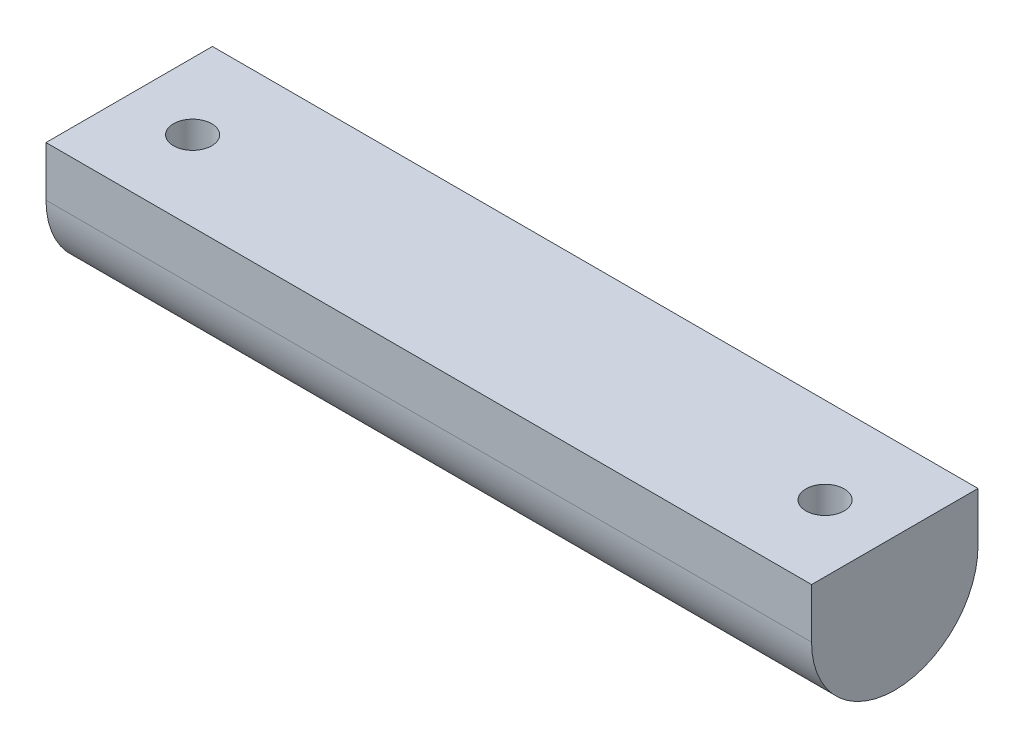
ISO-10303-21;
HEADER;
FILE_DESCRIPTION(('STEP AP214'),'2;1');
FILE_NAME('part.step','',(''),(''),'','','');
FILE_SCHEMA(('AUTOMOTIVE_DESIGN { 1 0 10303 214 1 1 1 1 }'));
ENDSEC;
DATA;
#1=APPLICATION_CONTEXT('core data for automotive mechanical design processes');
#2=APPLICATION_PROTOCOL_DEFINITION('international standard','automotive_design',2000,#1);
#3=PRODUCT_CONTEXT('',#1,'mechanical');
#4=PRODUCT('Part','Part','',(#3));
#5=PRODUCT_RELATED_PRODUCT_CATEGORY('part','',(#4));
#6=PRODUCT_DEFINITION_FORMATION('','',#4);
#7=PRODUCT_DEFINITION_CONTEXT('part definition',#1,'design');
#8=PRODUCT_DEFINITION('design','',#6,#7);
#9=PRODUCT_DEFINITION_SHAPE('','',#8);
#10=(LENGTH_UNIT() NAMED_UNIT(*) SI_UNIT(.MILLI.,.METRE.));
#11=(NAMED_UNIT(*) PLANE_ANGLE_UNIT() SI_UNIT($,.RADIAN.));
#12=(NAMED_UNIT(*) SI_UNIT($,.STERADIAN.) SOLID_ANGLE_UNIT());
#13=UNCERTAINTY_MEASURE_WITH_UNIT(LENGTH_MEASURE(1.E-05),#10,'distance_accuracy_value','');
#14=(GEOMETRIC_REPRESENTATION_CONTEXT(3) GLOBAL_UNCERTAINTY_ASSIGNED_CONTEXT((#13)) GLOBAL_UNIT_ASSIGNED_CONTEXT((#10,
#11,#12)) REPRESENTATION_CONTEXT('',''));
#15=CARTESIAN_POINT('',(0.,0.,0.));
#16=DIRECTION('',(0.,0.,1.));
#17=DIRECTION('',(1.,0.,0.));
#18=AXIS2_PLACEMENT_3D('',#15,#16,#17);
#19=CARTESIAN_POINT('',(230.,0.,-0.953079178885622));
#20=DIRECTION('',(-1.,0.,0.));
#21=DIRECTION('',(0.,0.,1.));
#22=AXIS2_PLACEMENT_3D('',#19,#20,#21);
#23=CYLINDRICAL_SURFACE('',#22,25.);
#24=CARTESIAN_POINT('',(14.3295379307525,-25.,-0.953079178885622));
#25=CARTESIAN_POINT('',(14.3032204154449,-25.0000022390417,-0.796524944286666));
#26=CARTESIAN_POINT('',(14.283403547646,-24.9985271644358,-0.638926225067683));
#27=CARTESIAN_POINT('',(14.2568675350783,-24.9925495309535,-0.322641837007087));
#28=CARTESIAN_POINT('',(14.2501500199997,-24.9880465954746,-0.163956035385695));
#29=CARTESIAN_POINT('',(14.2498548638924,-24.9760090292573,0.153357104046602));
#30=CARTESIAN_POINT('',(14.2562815027579,-24.968473411683,0.311984405988229));
#31=CARTESIAN_POINT('',(14.2822036954214,-24.9504523086873,0.628057321523648));
#32=CARTESIAN_POINT('',(14.301704000259,-24.9399657516831,0.785502484481084));
#33=CARTESIAN_POINT('',(14.3535591325346,-24.9162249444227,1.09783111698485));
#34=CARTESIAN_POINT('',(14.3858968706514,-24.9029743847184,1.25271770815543));
#35=CARTESIAN_POINT('',(14.4631618678009,-24.8739317342173,1.55913381445163));
#36=CARTESIAN_POINT('',(14.5080937771886,-24.8581387055411,1.71066206717816));
#37=CARTESIAN_POINT('',(14.6101588531816,-24.8243289375947,2.00922693484971));
#38=CARTESIAN_POINT('',(14.6672872413105,-24.806313070377,2.1562652831865));
#39=CARTESIAN_POINT('',(14.793344159261,-24.7684117634486,2.4450073157346));
#40=CARTESIAN_POINT('',(14.8622771290898,-24.7485256215527,2.58670896812298));
#41=CARTESIAN_POINT('',(15.0125043460582,-24.7070087819824,2.86580925068788));
#42=CARTESIAN_POINT('',(15.093961883232,-24.6853571335696,3.00311687185976));
#43=CARTESIAN_POINT('',(15.2679519624222,-24.6410307973897,3.2704224231089));
#44=CARTESIAN_POINT('',(15.3604885779391,-24.6183557352597,3.40041763861691));
#45=CARTESIAN_POINT('',(15.5559706367322,-24.5725021167474,3.65219087190974));
#46=CARTESIAN_POINT('',(15.6589138903542,-24.5493236670851,3.7739706093542));
#47=CARTESIAN_POINT('',(15.8745960253436,-24.5029785853046,4.00860901804945));
#48=CARTESIAN_POINT('',(15.9873385465955,-24.4798119608205,4.12146434439365));
#49=CARTESIAN_POINT('',(16.2245109406561,-24.4335239826306,4.33990222858453));
#50=CARTESIAN_POINT('',(16.3491465612219,-24.4104153523268,4.4452642806977));
#51=CARTESIAN_POINT('',(16.6070983124857,-24.3653525353509,4.64514350609272));
#52=CARTESIAN_POINT('',(16.7404177071474,-24.3433987884339,4.7396565642697));
#53=CARTESIAN_POINT('',(17.0147774820477,-24.3012272095911,4.91707232793482));
#54=CARTESIAN_POINT('',(17.1558147906821,-24.2810086951815,4.99997960626002));
#55=CARTESIAN_POINT('',(17.4446685580712,-24.2428274199846,5.15360202695747));
#56=CARTESIAN_POINT('',(17.5924874406972,-24.2248654744517,5.22431276637825));
#57=CARTESIAN_POINT('',(18.0418252284578,-24.1754507249369,5.41599818377823));
#58=CARTESIAN_POINT('',(18.3521172945124,-24.1480095861662,5.51839392862714));
#59=CARTESIAN_POINT('',(18.8272894700967,-24.1173084184242,5.63151256662128));
#60=CARTESIAN_POINT('',(18.9873613114815,-24.1088169599469,5.66247676103014));
#61=CARTESIAN_POINT('',(19.3097214068093,-24.0955208220363,5.71074058200066));
#62=CARTESIAN_POINT('',(19.4720096513324,-24.0907161269386,5.72804026661975));
#63=CARTESIAN_POINT('',(19.9495027262995,-24.0822917206927,5.75840022909593));
#64=CARTESIAN_POINT('',(20.2662293187365,-24.0839518559656,5.7524753782797));
#65=CARTESIAN_POINT('',(20.8938445772999,-24.101568017326,5.68886320348814));
#66=CARTESIAN_POINT('',(21.2047335191238,-24.1175233665438,5.63117833031799));
#67=CARTESIAN_POINT('',(21.8090862492864,-24.161771868801,5.46688007665178));
#68=CARTESIAN_POINT('',(22.1026905479246,-24.1899430233636,5.36074997723819));
#69=CARTESIAN_POINT('',(22.6680377955221,-24.2557509483203,5.10300418130992));
#70=CARTESIAN_POINT('',(22.9397774901488,-24.2933891243609,4.95138172952665));
#71=CARTESIAN_POINT('',(23.4617483561664,-24.3756445451164,4.60217979134951));
#72=CARTESIAN_POINT('',(23.7111906053401,-24.4204241606182,4.40345949495601));
#73=CARTESIAN_POINT('',(24.1737288000628,-24.5119230961102,3.9678036105785));
#74=CARTESIAN_POINT('',(24.3868185454067,-24.5586427453021,3.73086151694776));
#75=CARTESIAN_POINT('',(24.7762284467125,-24.6509717942483,3.21814108837073));
#76=CARTESIAN_POINT('',(24.9514418894326,-24.6965202521211,2.94150950299253));
#77=CARTESIAN_POINT('',(25.2527536727956,-24.7809950765968,2.36173412056259));
#78=CARTESIAN_POINT('',(25.3788547981598,-24.8199218185875,2.05859182789039));
#79=CARTESIAN_POINT('',(25.5770408455131,-24.8874452912236,1.43688506829215));
#80=CARTESIAN_POINT('',(25.649576545965,-24.916127154581,1.11847389005601));
#81=CARTESIAN_POINT('',(25.7397499806507,-24.9613785471944,0.473142045587918));
#82=CARTESIAN_POINT('',(25.7573976174883,-24.9779502608844,0.146222925045543));
#83=CARTESIAN_POINT('',(25.7372344944008,-24.9978728887552,-0.497655944596847));
#84=CARTESIAN_POINT('',(25.7008709726389,-25.0015602488029,-0.814651380411591));
#85=CARTESIAN_POINT('',(25.5763056273417,-24.9972378554185,-1.43818859021589));
#86=CARTESIAN_POINT('',(25.488105458735,-24.9892284754026,-1.74473069760623));
#87=CARTESIAN_POINT('',(25.263221994896,-24.96342631561,-2.3368084254988));
#88=CARTESIAN_POINT('',(25.1268442191378,-24.9456948065083,-2.62246303467202));
#89=CARTESIAN_POINT('',(24.809436808048,-24.9032601485104,-3.16721047549525));
#90=CARTESIAN_POINT('',(24.6284023060163,-24.8785562397182,-3.42630040776122));
#91=CARTESIAN_POINT('',(24.2229863326904,-24.825096932549,-3.915562522357));
#92=CARTESIAN_POINT('',(23.9978808946622,-24.7962764074241,-4.14512777040046));
#93=CARTESIAN_POINT('',(23.5126003937988,-24.7388068982349,-4.56364199458479));
#94=CARTESIAN_POINT('',(23.2524223477359,-24.7101579289796,-4.75258751211614));
#95=CARTESIAN_POINT('',(22.7004559417886,-24.6564716664804,-5.08678518840574));
#96=CARTESIAN_POINT('',(22.4083112158132,-24.6314843218128,-5.2314580086546));
#97=CARTESIAN_POINT('',(21.8033753867401,-24.5889435332959,-5.46955577290564));
#98=CARTESIAN_POINT('',(21.4905862082165,-24.5713893976158,-5.56298548649498));
#99=CARTESIAN_POINT('',(20.8567322291751,-24.5462763735618,-5.69490567699094));
#100=CARTESIAN_POINT('',(20.535800283754,-24.5386071557003,-5.73400297157918));
#101=CARTESIAN_POINT('',(20.0531657004183,-24.5350776764996,-5.75202061225854));
#102=CARTESIAN_POINT('',(19.8919991888074,-24.5352323500366,-5.75124437152855));
#103=CARTESIAN_POINT('',(19.5703396124318,-24.5381753170595,-5.73618007747943));
#104=CARTESIAN_POINT('',(19.409846316616,-24.5409626173237,-5.72189711989138));
#105=CARTESIAN_POINT('',(19.0928257192927,-24.5490260317769,-5.6802085251814));
#106=CARTESIAN_POINT('',(18.9362740630109,-24.5542685240284,-5.65298009196802));
#107=CARTESIAN_POINT('',(18.6261038156137,-24.5670504877621,-5.58570303374321));
#108=CARTESIAN_POINT('',(18.4724841704097,-24.5745891165759,-5.54565911166669));
#109=CARTESIAN_POINT('',(18.1691275584556,-24.5917187566403,-5.45303300264966));
#110=CARTESIAN_POINT('',(18.019392113054,-24.6013105588574,-5.40044598269966));
#111=CARTESIAN_POINT('',(17.7249340354364,-24.6222262382754,-5.28315079331366));
#112=CARTESIAN_POINT('',(17.5802096877731,-24.6335495154056,-5.21844682146513));
#113=CARTESIAN_POINT('',(17.2954638374411,-24.6576654120095,-5.07675983215242));
#114=CARTESIAN_POINT('',(17.1554935671313,-24.6704698452532,-4.99967586990379));
#115=CARTESIAN_POINT('',(16.8825657709456,-24.697041485555,-4.8342075718708));
#116=CARTESIAN_POINT('',(16.7496058056591,-24.710808353779,-4.74582720410239));
#117=CARTESIAN_POINT('',(16.4914515466829,-24.7388643196716,-4.55829523136982));
#118=CARTESIAN_POINT('',(16.3662618338497,-24.7531537176498,-4.45913736566428));
#119=CARTESIAN_POINT('',(16.1246067331412,-24.781769730818,-4.25079633812985));
#120=CARTESIAN_POINT('',(16.0081382641369,-24.7960963309963,-4.14161674750938));
#121=CARTESIAN_POINT('',(15.7828240743822,-24.8245447604804,-3.91205989283182));
#122=CARTESIAN_POINT('',(15.6741342207759,-24.8386594060363,-3.79152866588576));
#123=CARTESIAN_POINT('',(15.4673195188152,-24.8659376692751,-3.54169423770944));
#124=CARTESIAN_POINT('',(15.3691908915723,-24.8791016265633,-3.41239420120246));
#125=CARTESIAN_POINT('',(15.1841934612556,-24.9040026272062,-3.14591753477112));
#126=CARTESIAN_POINT('',(15.0973198944612,-24.9157402741173,-3.00874427290967));
#127=CARTESIAN_POINT('',(14.9354473423227,-24.9373498372926,-2.72748018558901));
#128=CARTESIAN_POINT('',(14.8604462879265,-24.9472220787038,-2.58339057117635));
#129=CARTESIAN_POINT('',(14.6817363527919,-24.9699253296153,-2.20131543691505));
#130=CARTESIAN_POINT('',(14.587634371607,-24.9810020754608,-1.95864742197571));
#131=CARTESIAN_POINT('',(14.4330673642174,-24.9960373687909,-1.46261106400319));
#132=CARTESIAN_POINT('',(14.3726003531728,-24.9999963363349,-1.20924335332143));
#133=CARTESIAN_POINT('',(14.3295379307525,-25.,-0.953079178885622));
#134=B_SPLINE_CURVE_WITH_KNOTS('',3,(#24,#25,#26,#27,#28,#29,#30,#31,#32,#33,#34,#35,#36,#37,
#38,#39,#40,#41,#42,#43,#44,#45,#46,#47,#48,#49,#50,#51,#52,#53,#54,#55,#56,#57,#58,#59,#60,#61,
#62,#63,#64,#65,#66,#67,#68,#69,#70,#71,#72,#73,#74,#75,#76,#77,#78,#79,#80,#81,#82,#83,#84,#85,
#86,#87,#88,#89,#90,#91,#92,#93,#94,#95,#96,#97,#98,#99,#100,#101,#102,#103,#104,#105,#106,#107,
#108,#109,#110,#111,#112,#113,#114,#115,#116,#117,#118,#119,#120,#121,#122,#123,#124,#125,#126,
#127,#128,#129,#130,#131,#132,#133),.UNSPECIFIED.,.T.,.F.,(4,2,2,2,2,2,2,2,2,2,2,2,2,2,2,2,2,2,
2,2,2,2,2,2,2,2,2,2,2,2,2,2,2,2,2,2,2,2,2,2,2,2,2,2,2,2,2,2,2,2,2,2,2,2,4),(0.,
0.476027169707608,0.952113558168828,1.42835499074974,1.90476958587459,2.38055208842228,
2.85651050399832,3.33228278422398,3.8082344092945,4.29102054989,4.77398474719205,
5.25684753497594,5.73989045232327,6.23379148640104,6.72787924608981,7.2217717771171,
7.71584223191195,8.69369312824933,9.18296735713278,9.67223950718872,10.6176082383934,
11.5629322093329,12.4990252115377,13.4352572852916,14.3970282615393,15.3589631117399,
16.3460419759306,17.3330648635349,18.311683755875,19.2901260809113,20.2428194208548,
21.195482346912,22.1422092935145,23.0890394602514,24.0529736843132,25.016989951086,
25.9931290497532,26.9691772762768,27.9342343203263,28.4172539535452,28.9000914287583,
29.3765019534605,29.8527378485778,30.3291575405038,30.8054124941125,31.2857688066602,
31.7659568488638,32.2464253425575,32.7267232826935,33.2148783192506,33.7028581053767,
34.1906306738721,34.6783181432289,35.4572705895087,36.2361770639937),.UNSPECIFIED.);
#135=CARTESIAN_POINT('',(14.3295379307525,-25.,-0.953079178885622));
#136=VERTEX_POINT('',#135);
#137=EDGE_CURVE('E11',#136,#136,#134,.T.);
#138=ORIENTED_EDGE('',*,*,#137,.T.);
#139=EDGE_LOOP('',(#138));
#140=FACE_BOUND('',#139,.T.);
#141=CARTESIAN_POINT('',(204.329537930752,-25.,-0.953079178885622));
#142=CARTESIAN_POINT('',(204.303220415445,-25.0000022390417,-0.796524944286666));
#143=CARTESIAN_POINT('',(204.283403547646,-24.9985271644358,-0.638926225067683));
#144=CARTESIAN_POINT('',(204.256867535078,-24.9925495309535,-0.322641837007086));
#145=CARTESIAN_POINT('',(204.25015002,-24.9880465954746,-0.163956035385692));
#146=CARTESIAN_POINT('',(204.249854863892,-24.9760090292573,0.153357104046608));
#147=CARTESIAN_POINT('',(204.256281502758,-24.968473411683,0.311984405988236));
#148=CARTESIAN_POINT('',(204.282203695421,-24.9504523086873,0.628057321523656));
#149=CARTESIAN_POINT('',(204.301704000259,-24.9399657516831,0.785502484481091));
#150=CARTESIAN_POINT('',(204.353559132535,-24.9162249444227,1.09783111698486));
#151=CARTESIAN_POINT('',(204.385896870651,-24.9029743847184,1.25271770815544));
#152=CARTESIAN_POINT('',(204.463161867801,-24.8739317342173,1.55913381445164));
#153=CARTESIAN_POINT('',(204.508093777189,-24.8581387055411,1.71066206717816));
#154=CARTESIAN_POINT('',(204.610158853182,-24.8243289375947,2.00922693484971));
#155=CARTESIAN_POINT('',(204.667287241311,-24.806313070377,2.15626528318651));
#156=CARTESIAN_POINT('',(204.793344159261,-24.7684117634486,2.44500731573462));
#157=CARTESIAN_POINT('',(204.86227712909,-24.7485256215527,2.58670896812299));
#158=CARTESIAN_POINT('',(205.012504346058,-24.7070087819824,2.86580925068789));
#159=CARTESIAN_POINT('',(205.093961883232,-24.6853571335696,3.00311687185978));
#160=CARTESIAN_POINT('',(205.267951962422,-24.6410307973897,3.27042242310891));
#161=CARTESIAN_POINT('',(205.360488577939,-24.6183557352597,3.40041763861692));
#162=CARTESIAN_POINT('',(205.555970636732,-24.5725021167474,3.65219087190975));
#163=CARTESIAN_POINT('',(205.658913890354,-24.5493236670851,3.77397060935421));
#164=CARTESIAN_POINT('',(205.874596025344,-24.5029785853046,4.00860901804946));
#165=CARTESIAN_POINT('',(205.987338546596,-24.4798119608205,4.12146434439365));
#166=CARTESIAN_POINT('',(206.224510940656,-24.4335239826306,4.33990222858454));
#167=CARTESIAN_POINT('',(206.349146561222,-24.4104153523268,4.4452642806977));
#168=CARTESIAN_POINT('',(206.607098312486,-24.3653525353509,4.64514350609273));
#169=CARTESIAN_POINT('',(206.740417707147,-24.3433987884339,4.73965656426971));
#170=CARTESIAN_POINT('',(207.014777482048,-24.3012272095911,4.91707232793483));
#171=CARTESIAN_POINT('',(207.155814790682,-24.2810086951815,4.99997960626003));
#172=CARTESIAN_POINT('',(207.444668558071,-24.2428274199846,5.15360202695748));
#173=CARTESIAN_POINT('',(207.592487440697,-24.2248654744517,5.22431276637826));
#174=CARTESIAN_POINT('',(208.041825228458,-24.1754507249369,5.41599818377823));
#175=CARTESIAN_POINT('',(208.352117294512,-24.1480095861662,5.51839392862714));
#176=CARTESIAN_POINT('',(208.827289470097,-24.1173084184242,5.63151256662129));
#177=CARTESIAN_POINT('',(208.987361311481,-24.1088169599469,5.66247676103015));
#178=CARTESIAN_POINT('',(209.309721406809,-24.0955208220363,5.71074058200066));
#179=CARTESIAN_POINT('',(209.472009651332,-24.0907161269386,5.72804026661975));
#180=CARTESIAN_POINT('',(209.949502726299,-24.0822917206927,5.75840022909593));
#181=CARTESIAN_POINT('',(210.266229318737,-24.0839518559656,5.7524753782797));
#182=CARTESIAN_POINT('',(210.8938445773,-24.101568017326,5.68886320348814));
#183=CARTESIAN_POINT('',(211.204733519124,-24.1175233665438,5.63117833031798));
#184=CARTESIAN_POINT('',(211.809086249286,-24.161771868801,5.46688007665177));
#185=CARTESIAN_POINT('',(212.102690547925,-24.1899430233636,5.36074997723818));
#186=CARTESIAN_POINT('',(212.668037795522,-24.2557509483203,5.10300418130992));
#187=CARTESIAN_POINT('',(212.939777490149,-24.2933891243609,4.95138172952665));
#188=CARTESIAN_POINT('',(213.461748356166,-24.3756445451164,4.6021797913495));
#189=CARTESIAN_POINT('',(213.71119060534,-24.4204241606182,4.403459494956));
#190=CARTESIAN_POINT('',(214.173728800063,-24.5119230961102,3.96780361057849));
#191=CARTESIAN_POINT('',(214.386818545407,-24.5586427453021,3.73086151694775));
#192=CARTESIAN_POINT('',(214.776228446712,-24.6509717942483,3.21814108837073));
#193=CARTESIAN_POINT('',(214.951441889433,-24.6965202521211,2.94150950299252));
#194=CARTESIAN_POINT('',(215.252753672796,-24.7809950765968,2.36173412056258));
#195=CARTESIAN_POINT('',(215.37885479816,-24.8199218185875,2.05859182789038));
#196=CARTESIAN_POINT('',(215.577040845513,-24.8874452912236,1.43688506829214));
#197=CARTESIAN_POINT('',(215.649576545965,-24.916127154581,1.118473890056));
#198=CARTESIAN_POINT('',(215.739749980651,-24.9613785471944,0.473142045587905));
#199=CARTESIAN_POINT('',(215.757397617488,-24.9779502608844,0.146222925045531));
#200=CARTESIAN_POINT('',(215.737234494401,-24.9978728887552,-0.497655944596858));
#201=CARTESIAN_POINT('',(215.700870972639,-25.0015602488029,-0.814651380411601));
#202=CARTESIAN_POINT('',(215.576305627342,-24.9972378554185,-1.4381885902159));
#203=CARTESIAN_POINT('',(215.488105458735,-24.9892284754026,-1.74473069760624));
#204=CARTESIAN_POINT('',(215.263221994896,-24.96342631561,-2.3368084254988));
#205=CARTESIAN_POINT('',(215.126844219138,-24.9456948065083,-2.62246303467203));
#206=CARTESIAN_POINT('',(214.809436808048,-24.9032601485104,-3.16721047549525));
#207=CARTESIAN_POINT('',(214.628402306016,-24.8785562397182,-3.42630040776123));
#208=CARTESIAN_POINT('',(214.22298633269,-24.825096932549,-3.91556252235701));
#209=CARTESIAN_POINT('',(213.997880894662,-24.7962764074241,-4.14512777040047));
#210=CARTESIAN_POINT('',(213.512600393799,-24.7388068982349,-4.5636419945848));
#211=CARTESIAN_POINT('',(213.252422347736,-24.7101579289796,-4.75258751211615));
#212=CARTESIAN_POINT('',(212.700455941789,-24.6564716664804,-5.08678518840576));
#213=CARTESIAN_POINT('',(212.408311215813,-24.6314843218128,-5.2314580086546));
#214=CARTESIAN_POINT('',(211.80337538674,-24.5889435332959,-5.46955577290565));
#215=CARTESIAN_POINT('',(211.490586208216,-24.5713893976158,-5.56298548649499));
#216=CARTESIAN_POINT('',(210.856732229175,-24.5462763735618,-5.69490567699094));
#217=CARTESIAN_POINT('',(210.535800283754,-24.5386071557003,-5.73400297157918));
#218=CARTESIAN_POINT('',(210.053165700418,-24.5350776764996,-5.75202061225854));
#219=CARTESIAN_POINT('',(209.891999188807,-24.5352323500366,-5.75124437152855));
#220=CARTESIAN_POINT('',(209.570339612432,-24.5381753170595,-5.73618007747943));
#221=CARTESIAN_POINT('',(209.409846316616,-24.5409626173237,-5.72189711989138));
#222=CARTESIAN_POINT('',(209.092825719293,-24.5490260317769,-5.6802085251814));
#223=CARTESIAN_POINT('',(208.936274063011,-24.5542685240284,-5.65298009196802));
#224=CARTESIAN_POINT('',(208.626103815614,-24.5670504877621,-5.58570303374321));
#225=CARTESIAN_POINT('',(208.47248417041,-24.5745891165759,-5.54565911166669));
#226=CARTESIAN_POINT('',(208.169127558456,-24.5917187566403,-5.45303300264966));
#227=CARTESIAN_POINT('',(208.019392113054,-24.6013105588574,-5.40044598269966));
#228=CARTESIAN_POINT('',(207.724934035436,-24.6222262382754,-5.28315079331366));
#229=CARTESIAN_POINT('',(207.580209687773,-24.6335495154056,-5.21844682146512));
#230=CARTESIAN_POINT('',(207.295463837441,-24.6576654120095,-5.07675983215241));
#231=CARTESIAN_POINT('',(207.155493567131,-24.6704698452532,-4.99967586990378));
#232=CARTESIAN_POINT('',(206.882565770946,-24.697041485555,-4.8342075718708));
#233=CARTESIAN_POINT('',(206.749605805659,-24.710808353779,-4.74582720410239));
#234=CARTESIAN_POINT('',(206.491451546683,-24.7388643196716,-4.55829523136982));
#235=CARTESIAN_POINT('',(206.36626183385,-24.7531537176498,-4.45913736566428));
#236=CARTESIAN_POINT('',(206.124606733141,-24.781769730818,-4.25079633812984));
#237=CARTESIAN_POINT('',(206.008138264137,-24.7960963309963,-4.14161674750937));
#238=CARTESIAN_POINT('',(205.782824074382,-24.8245447604804,-3.9120598928318));
#239=CARTESIAN_POINT('',(205.674134220776,-24.8386594060363,-3.79152866588575));
#240=CARTESIAN_POINT('',(205.467319518815,-24.8659376692751,-3.54169423770943));
#241=CARTESIAN_POINT('',(205.369190891572,-24.8791016265633,-3.41239420120245));
#242=CARTESIAN_POINT('',(205.184193461256,-24.9040026272062,-3.14591753477111));
#243=CARTESIAN_POINT('',(205.097319894461,-24.9157402741173,-3.00874427290967));
#244=CARTESIAN_POINT('',(204.935447342323,-24.9373498372926,-2.72748018558901));
#245=CARTESIAN_POINT('',(204.860446287927,-24.9472220787038,-2.58339057117635));
#246=CARTESIAN_POINT('',(204.681736352792,-24.9699253296153,-2.20131543691505));
#247=CARTESIAN_POINT('',(204.587634371607,-24.9810020754608,-1.95864742197571));
#248=CARTESIAN_POINT('',(204.433067364217,-24.9960373687909,-1.46261106400319));
#249=CARTESIAN_POINT('',(204.372600353173,-24.9999963363349,-1.20924335332144));
#250=CARTESIAN_POINT('',(204.329537930752,-25.,-0.953079178885622));
#251=B_SPLINE_CURVE_WITH_KNOTS('',3,(#141,#142,#143,#144,#145,#146,#147,#148,#149,#150,#151,
#152,#153,#154,#155,#156,#157,#158,#159,#160,#161,#162,#163,#164,#165,#166,#167,#168,#169,#170,
#171,#172,#173,#174,#175,#176,#177,#178,#179,#180,#181,#182,#183,#184,#185,#186,#187,#188,#189,
#190,#191,#192,#193,#194,#195,#196,#197,#198,#199,#200,#201,#202,#203,#204,#205,#206,#207,#208,
#209,#210,#211,#212,#213,#214,#215,#216,#217,#218,#219,#220,#221,#222,#223,#224,#225,#226,#227,
#228,#229,#230,#231,#232,#233,#234,#235,#236,#237,#238,#239,#240,#241,#242,#243,#244,#245,#246,
#247,#248,#249,#250),.UNSPECIFIED.,.T.,.F.,(4,2,2,2,2,2,2,2,2,2,2,2,2,2,2,2,2,2,2,2,2,2,2,2,2,2,
2,2,2,2,2,2,2,2,2,2,2,2,2,2,2,2,2,2,2,2,2,2,2,2,2,2,2,2,4),(0.,0.476027169707609,
0.952113558168831,1.42835499074975,1.9047695858746,2.38055208842229,2.85651050399833,
3.332282784224,3.80823440929451,4.29102054989002,4.77398474719204,5.25684753497595,
5.73989045232327,6.23379148640105,6.72787924608983,7.22177177711712,7.71584223191197,
8.69369312824936,9.18296735713281,9.67223950718876,10.6176082383935,11.5629322093329,
12.4990252115377,13.4352572852917,14.3970282615393,15.3589631117399,16.3460419759306,
17.3330648635349,18.311683755875,19.2901260809114,20.2428194208548,21.195482346912,
22.1422092935145,23.0890394602514,24.0529736843133,25.016989951086,25.9931290497532,
26.9691772762768,27.9342343203263,28.4172539535452,28.9000914287583,29.3765019534605,
29.8527378485778,30.3291575405038,30.8054124941125,31.2857688066602,31.7659568488638,
32.2464253425575,32.7267232826935,33.2148783192507,33.7028581053767,34.1906306738721,
34.6783181432289,35.4572705895087,36.2361770639937),.UNSPECIFIED.);
#252=CARTESIAN_POINT('',(204.329537930752,-25.,-0.953079178885622));
#253=VERTEX_POINT('',#252);
#254=EDGE_CURVE('E57',#253,#253,#251,.T.);
#255=ORIENTED_EDGE('',*,*,#254,.T.);
#256=EDGE_LOOP('',(#255));
#257=FACE_BOUND('',#256,.T.);
#258=CARTESIAN_POINT('',(0.,0.,-0.953079178885622));
#259=DIRECTION('',(1.,0.,0.));
#260=DIRECTION('',(0.,0.,-1.));
#261=AXIS2_PLACEMENT_3D('',#258,#259,#260);
#262=CIRCLE('',#261,25.);
#263=CARTESIAN_POINT('',(0.,0.,24.0469208211144));
#264=VERTEX_POINT('',#263);
#265=CARTESIAN_POINT('',(0.,0.,-25.9530791788856));
#266=VERTEX_POINT('',#265);
#267=EDGE_CURVE('E120',#264,#266,#262,.T.);
#268=ORIENTED_EDGE('',*,*,#267,.T.);
#269=DIRECTION('',(-1.,0.,0.));
#270=VECTOR('',#269,1.);
#271=CARTESIAN_POINT('',(230.,0.,-25.9530791788856));
#272=LINE('',#271,#270);
#273=CARTESIAN_POINT('',(230.,0.,-25.9530791788856));
#274=VERTEX_POINT('',#273);
#275=EDGE_CURVE('E109',#274,#266,#272,.T.);
#276=ORIENTED_EDGE('',*,*,#275,.F.);
#277=CARTESIAN_POINT('',(230.,0.,-0.953079178885622));
#278=DIRECTION('',(1.,0.,0.));
#279=DIRECTION('',(0.,0.,-1.));
#280=AXIS2_PLACEMENT_3D('',#277,#278,#279);
#281=CIRCLE('',#280,25.);
#282=CARTESIAN_POINT('',(230.,0.,24.0469208211144));
#283=VERTEX_POINT('',#282);
#284=EDGE_CURVE('E101',#283,#274,#281,.T.);
#285=ORIENTED_EDGE('',*,*,#284,.F.);
#286=DIRECTION('',(-1.,0.,0.));
#287=VECTOR('',#286,1.);
#288=CARTESIAN_POINT('',(230.,0.,24.0469208211144));
#289=LINE('',#288,#287);
#290=EDGE_CURVE('E116',#283,#264,#289,.T.);
#291=ORIENTED_EDGE('',*,*,#290,.T.);
#292=EDGE_LOOP('',(#268,#276,#285,#291));
#293=FACE_BOUND('',#292,.T.);
#294=ADVANCED_FACE('F43',(#140,#257,#293),#23,.T.);
#295=CARTESIAN_POINT('',(230.,15.,-25.9530791788856));
#296=DIRECTION('',(0.,0.,1.));
#297=DIRECTION('',(0.,-1.,0.));
#298=AXIS2_PLACEMENT_3D('',#295,#296,#297);
#299=PLANE('',#298);
#300=DIRECTION('',(0.,1.,0.));
#301=VECTOR('',#300,1.);
#302=CARTESIAN_POINT('',(0.,15.,-25.9530791788856));
#303=LINE('',#302,#301);
#304=CARTESIAN_POINT('',(0.,15.,-25.9530791788856));
#305=VERTEX_POINT('',#304);
#306=EDGE_CURVE('E107',#266,#305,#303,.T.);
#307=ORIENTED_EDGE('',*,*,#306,.T.);
#308=DIRECTION('',(-1.,0.,0.));
#309=VECTOR('',#308,1.);
#310=CARTESIAN_POINT('',(230.,15.,-25.9530791788856));
#311=LINE('',#310,#309);
#312=CARTESIAN_POINT('',(230.,15.,-25.9530791788856));
#313=VERTEX_POINT('',#312);
#314=EDGE_CURVE('E105',#313,#305,#311,.T.);
#315=ORIENTED_EDGE('',*,*,#314,.F.);
#316=DIRECTION('',(0.,1.,0.));
#317=VECTOR('',#316,1.);
#318=CARTESIAN_POINT('',(230.,15.,-25.9530791788856));
#319=LINE('',#318,#317);
#320=EDGE_CURVE('E96',#274,#313,#319,.T.);
#321=ORIENTED_EDGE('',*,*,#320,.F.);
#322=ORIENTED_EDGE('',*,*,#275,.T.);
#323=EDGE_LOOP('',(#307,#315,#321,#322));
#324=FACE_BOUND('',#323,.T.);
#325=ADVANCED_FACE('F106',(#324),#299,.F.);
#326=CARTESIAN_POINT('',(230.,15.,24.0469208211144));
#327=DIRECTION('',(0.,-1.,0.));
#328=DIRECTION('',(0.,0.,-1.));
#329=AXIS2_PLACEMENT_3D('',#326,#327,#328);
#330=PLANE('',#329);
#331=CARTESIAN_POINT('',(20.,15.,0.));
#332=DIRECTION('',(0.,1.,0.));
#333=DIRECTION('',(0.,0.,1.));
#334=AXIS2_PLACEMENT_3D('',#331,#332,#333);
#335=CIRCLE('',#334,5.74999999999999);
#336=CARTESIAN_POINT('',(20.,15.,5.74999999999999));
#337=VERTEX_POINT('',#336);
#338=EDGE_CURVE('E177',#337,#337,#335,.T.);
#339=ORIENTED_EDGE('',*,*,#338,.F.);
#340=EDGE_LOOP('',(#339));
#341=FACE_BOUND('',#340,.T.);
#342=CARTESIAN_POINT('',(210.,15.,0.));
#343=DIRECTION('',(0.,1.,0.));
#344=DIRECTION('',(0.,0.,1.));
#345=AXIS2_PLACEMENT_3D('',#342,#343,#344);
#346=CIRCLE('',#345,5.74999999999998);
#347=CARTESIAN_POINT('',(210.,15.,5.74999999999998));
#348=VERTEX_POINT('',#347);
#349=EDGE_CURVE('E124',#348,#348,#346,.T.);
#350=ORIENTED_EDGE('',*,*,#349,.F.);
#351=EDGE_LOOP('',(#350));
#352=FACE_BOUND('',#351,.T.);
#353=DIRECTION('',(0.,0.,1.));
#354=VECTOR('',#353,1.);
#355=CARTESIAN_POINT('',(0.,15.,24.0469208211144));
#356=LINE('',#355,#354);
#357=CARTESIAN_POINT('',(0.,15.,24.0469208211144));
#358=VERTEX_POINT('',#357);
#359=EDGE_CURVE('E82',#305,#358,#356,.T.);
#360=ORIENTED_EDGE('',*,*,#359,.T.);
#361=DIRECTION('',(-1.,0.,0.));
#362=VECTOR('',#361,1.);
#363=CARTESIAN_POINT('',(230.,15.,24.0469208211144));
#364=LINE('',#363,#362);
#365=CARTESIAN_POINT('',(230.,15.,24.0469208211144));
#366=VERTEX_POINT('',#365);
#367=EDGE_CURVE('E110',#366,#358,#364,.T.);
#368=ORIENTED_EDGE('',*,*,#367,.F.);
#369=DIRECTION('',(0.,0.,1.));
#370=VECTOR('',#369,1.);
#371=CARTESIAN_POINT('',(230.,15.,24.0469208211144));
#372=LINE('',#371,#370);
#373=EDGE_CURVE('E99',#313,#366,#372,.T.);
#374=ORIENTED_EDGE('',*,*,#373,.F.);
#375=ORIENTED_EDGE('',*,*,#314,.T.);
#376=EDGE_LOOP('',(#360,#368,#374,#375));
#377=FACE_BOUND('',#376,.T.);
#378=ADVANCED_FACE('F112',(#341,#352,#377),#330,.F.);
#379=CARTESIAN_POINT('',(230.,0.,24.0469208211144));
#380=DIRECTION('',(0.,0.,-1.));
#381=DIRECTION('',(-1.,0.,0.));
#382=AXIS2_PLACEMENT_3D('',#379,#380,#381);
#383=PLANE('',#382);
#384=DIRECTION('',(0.,-1.,0.));
#385=VECTOR('',#384,1.);
#386=CARTESIAN_POINT('',(0.,0.,24.0469208211144));
#387=LINE('',#386,#385);
#388=EDGE_CURVE('E88',#358,#264,#387,.T.);
#389=ORIENTED_EDGE('',*,*,#388,.T.);
#390=ORIENTED_EDGE('',*,*,#290,.F.);
#391=DIRECTION('',(0.,-1.,0.));
#392=VECTOR('',#391,1.);
#393=CARTESIAN_POINT('',(230.,0.,24.0469208211144));
#394=LINE('',#393,#392);
#395=EDGE_CURVE('E65',#366,#283,#394,.T.);
#396=ORIENTED_EDGE('',*,*,#395,.F.);
#397=ORIENTED_EDGE('',*,*,#367,.T.);
#398=EDGE_LOOP('',(#389,#390,#396,#397));
#399=FACE_BOUND('',#398,.T.);
#400=ADVANCED_FACE('F152',(#399),#383,.F.);
#401=CARTESIAN_POINT('',(230.,0.,-0.953079178885622));
#402=DIRECTION('',(1.,0.,0.));
#403=DIRECTION('',(0.,0.,-1.));
#404=AXIS2_PLACEMENT_3D('',#401,#402,#403);
#405=PLANE('',#404);
#406=ORIENTED_EDGE('',*,*,#284,.T.);
#407=ORIENTED_EDGE('',*,*,#320,.T.);
#408=ORIENTED_EDGE('',*,*,#373,.T.);
#409=ORIENTED_EDGE('',*,*,#395,.T.);
#410=EDGE_LOOP('',(#406,#407,#408,#409));
#411=FACE_BOUND('',#410,.T.);
#412=ADVANCED_FACE('F97',(#411),#405,.T.);
#413=CARTESIAN_POINT('',(0.,0.,-0.953079178885622));
#414=DIRECTION('',(1.,0.,0.));
#415=DIRECTION('',(0.,0.,-1.));
#416=AXIS2_PLACEMENT_3D('',#413,#414,#415);
#417=PLANE('',#416);
#418=ORIENTED_EDGE('',*,*,#267,.F.);
#419=ORIENTED_EDGE('',*,*,#388,.F.);
#420=ORIENTED_EDGE('',*,*,#359,.F.);
#421=ORIENTED_EDGE('',*,*,#306,.F.);
#422=EDGE_LOOP('',(#418,#419,#420,#421));
#423=FACE_BOUND('',#422,.T.);
#424=ADVANCED_FACE('F147',(#423),#417,.F.);
#425=CARTESIAN_POINT('',(210.,15.,0.));
#426=DIRECTION('',(0.,1.,0.));
#427=DIRECTION('',(0.,0.,1.));
#428=AXIS2_PLACEMENT_3D('',#425,#426,#427);
#429=CYLINDRICAL_SURFACE('',#428,5.74999999999999);
#430=ORIENTED_EDGE('',*,*,#349,.T.);
#431=EDGE_LOOP('',(#430));
#432=FACE_BOUND('',#431,.T.);
#433=ORIENTED_EDGE('',*,*,#254,.F.);
#434=EDGE_LOOP('',(#433));
#435=FACE_BOUND('',#434,.T.);
#436=ADVANCED_FACE('F142',(#432,#435),#429,.F.);
#437=CARTESIAN_POINT('',(20.,15.,0.));
#438=DIRECTION('',(0.,1.,0.));
#439=DIRECTION('',(0.,0.,1.));
#440=AXIS2_PLACEMENT_3D('',#437,#438,#439);
#441=CYLINDRICAL_SURFACE('',#440,5.74999999999999);
#442=ORIENTED_EDGE('',*,*,#338,.T.);
#443=EDGE_LOOP('',(#442));
#444=FACE_BOUND('',#443,.T.);
#445=ORIENTED_EDGE('',*,*,#137,.F.);
#446=EDGE_LOOP('',(#445));
#447=FACE_BOUND('',#446,.T.);
#448=ADVANCED_FACE('F146',(#444,#447),#441,.F.);
#449=CLOSED_SHELL('',(#294,#325,#378,#400,#412,#424,#436,#448));
#450=MANIFOLD_SOLID_BREP('B2',#449);
#451=ADVANCED_BREP_SHAPE_REPRESENTATION('',(#18,#450),#14);
#452=SHAPE_DEFINITION_REPRESENTATION(#9,#451);
ENDSEC;
END-ISO-10303-21;
